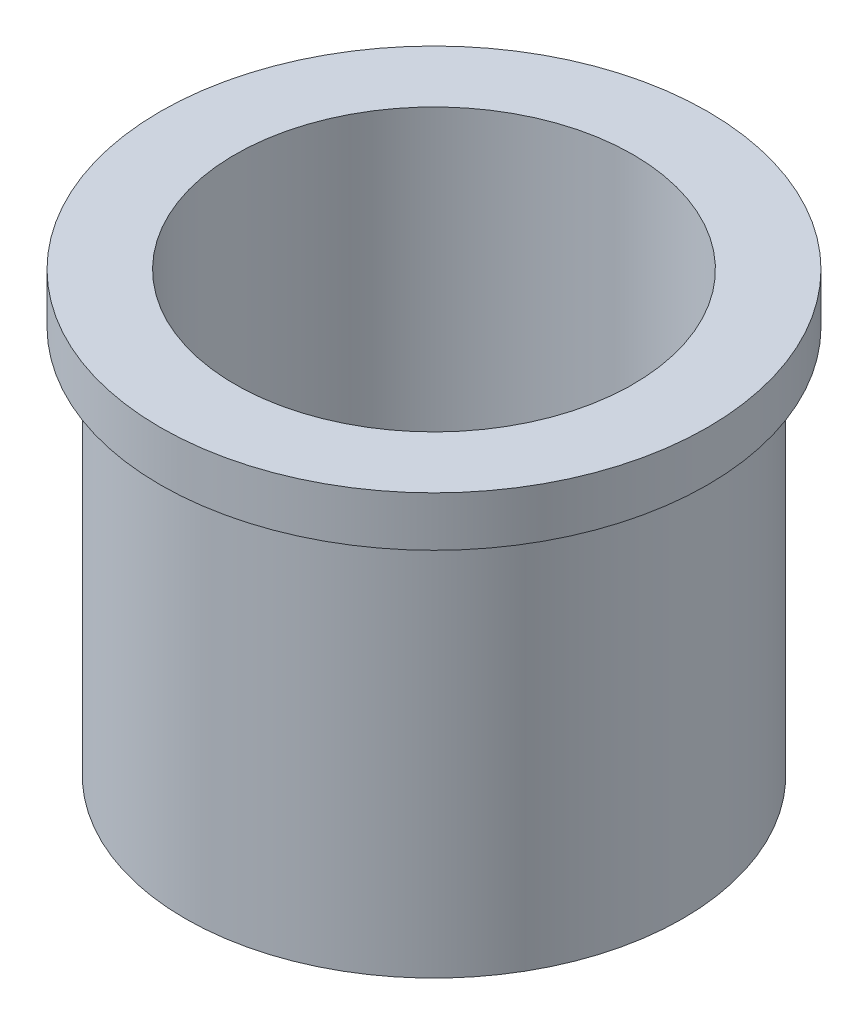
ISO-10303-21;
HEADER;
FILE_DESCRIPTION(('STEP AP214'),'2;1');
FILE_NAME('part.step','',(''),(''),'','','');
FILE_SCHEMA(('AUTOMOTIVE_DESIGN { 1 0 10303 214 1 1 1 1 }'));
ENDSEC;
DATA;
#1=APPLICATION_CONTEXT('core data for automotive mechanical design processes');
#2=APPLICATION_PROTOCOL_DEFINITION('international standard','automotive_design',2000,#1);
#3=PRODUCT_CONTEXT('',#1,'mechanical');
#4=PRODUCT('Part','Part','',(#3));
#5=PRODUCT_RELATED_PRODUCT_CATEGORY('part','',(#4));
#6=PRODUCT_DEFINITION_FORMATION('','',#4);
#7=PRODUCT_DEFINITION_CONTEXT('part definition',#1,'design');
#8=PRODUCT_DEFINITION('design','',#6,#7);
#9=PRODUCT_DEFINITION_SHAPE('','',#8);
#10=(LENGTH_UNIT() NAMED_UNIT(*) SI_UNIT(.MILLI.,.METRE.));
#11=(NAMED_UNIT(*) PLANE_ANGLE_UNIT() SI_UNIT($,.RADIAN.));
#12=(NAMED_UNIT(*) SI_UNIT($,.STERADIAN.) SOLID_ANGLE_UNIT());
#13=UNCERTAINTY_MEASURE_WITH_UNIT(LENGTH_MEASURE(1.E-05),#10,'distance_accuracy_value','');
#14=(GEOMETRIC_REPRESENTATION_CONTEXT(3) GLOBAL_UNCERTAINTY_ASSIGNED_CONTEXT((#13)) GLOBAL_UNIT_ASSIGNED_CONTEXT((#10,
#11,#12)) REPRESENTATION_CONTEXT('',''));
#15=CARTESIAN_POINT('',(0.,0.,0.));
#16=DIRECTION('',(0.,0.,1.));
#17=DIRECTION('',(1.,0.,0.));
#18=AXIS2_PLACEMENT_3D('',#15,#16,#17);
#19=CARTESIAN_POINT('',(0.,19.812,0.));
#20=DIRECTION('',(0.,-1.,0.));
#21=DIRECTION('',(0.,0.,-1.));
#22=AXIS2_PLACEMENT_3D('',#19,#20,#21);
#23=CYLINDRICAL_SURFACE('',#22,12.7);
#24=CARTESIAN_POINT('',(0.,19.812,0.));
#25=DIRECTION('',(0.,1.,0.));
#26=DIRECTION('',(0.,0.,1.));
#27=AXIS2_PLACEMENT_3D('',#24,#25,#26);
#28=CIRCLE('',#27,12.7);
#29=CARTESIAN_POINT('',(0.,19.812,12.7));
#30=VERTEX_POINT('',#29);
#31=EDGE_CURVE('E10',#30,#30,#28,.T.);
#32=ORIENTED_EDGE('',*,*,#31,.F.);
#33=EDGE_LOOP('',(#32));
#34=FACE_BOUND('',#33,.T.);
#35=CARTESIAN_POINT('',(0.,0.,0.));
#36=DIRECTION('',(0.,1.,0.));
#37=DIRECTION('',(0.,0.,1.));
#38=AXIS2_PLACEMENT_3D('',#35,#36,#37);
#39=CIRCLE('',#38,12.7);
#40=CARTESIAN_POINT('',(0.,0.,12.7));
#41=VERTEX_POINT('',#40);
#42=EDGE_CURVE('E35',#41,#41,#39,.T.);
#43=ORIENTED_EDGE('',*,*,#42,.T.);
#44=EDGE_LOOP('',(#43));
#45=FACE_BOUND('',#44,.T.);
#46=ADVANCED_FACE('F32',(#34,#45),#23,.T.);
#47=CARTESIAN_POINT('',(0.,0.,0.));
#48=DIRECTION('',(0.,1.,0.));
#49=DIRECTION('',(0.,0.,1.));
#50=AXIS2_PLACEMENT_3D('',#47,#48,#49);
#51=PLANE('',#50);
#52=CARTESIAN_POINT('',(0.,0.,0.));
#53=DIRECTION('',(0.,-1.,0.));
#54=DIRECTION('',(0.,0.,-1.));
#55=AXIS2_PLACEMENT_3D('',#52,#53,#54);
#56=CIRCLE('',#55,10.16);
#57=CARTESIAN_POINT('',(0.,0.,-10.16));
#58=VERTEX_POINT('',#57);
#59=EDGE_CURVE('E50',#58,#58,#56,.T.);
#60=ORIENTED_EDGE('',*,*,#59,.F.);
#61=EDGE_LOOP('',(#60));
#62=FACE_BOUND('',#61,.T.);
#63=ORIENTED_EDGE('',*,*,#42,.F.);
#64=EDGE_LOOP('',(#63));
#65=FACE_BOUND('',#64,.T.);
#66=ADVANCED_FACE('F66',(#62,#65),#51,.F.);
#67=CARTESIAN_POINT('',(0.,22.352,0.));
#68=DIRECTION('',(0.,-1.,0.));
#69=DIRECTION('',(0.,0.,-1.));
#70=AXIS2_PLACEMENT_3D('',#67,#68,#69);
#71=CYLINDRICAL_SURFACE('',#70,13.97);
#72=CARTESIAN_POINT('',(0.,22.352,0.));
#73=DIRECTION('',(0.,1.,0.));
#74=DIRECTION('',(0.,0.,1.));
#75=AXIS2_PLACEMENT_3D('',#72,#73,#74);
#76=CIRCLE('',#75,13.97);
#77=CARTESIAN_POINT('',(0.,22.352,13.97));
#78=VERTEX_POINT('',#77);
#79=EDGE_CURVE('E42',#78,#78,#76,.T.);
#80=ORIENTED_EDGE('',*,*,#79,.F.);
#81=EDGE_LOOP('',(#80));
#82=FACE_BOUND('',#81,.T.);
#83=CARTESIAN_POINT('',(0.,19.812,0.));
#84=DIRECTION('',(0.,1.,0.));
#85=DIRECTION('',(0.,0.,1.));
#86=AXIS2_PLACEMENT_3D('',#83,#84,#85);
#87=CIRCLE('',#86,13.97);
#88=CARTESIAN_POINT('',(0.,19.812,13.97));
#89=VERTEX_POINT('',#88);
#90=EDGE_CURVE('E44',#89,#89,#87,.T.);
#91=ORIENTED_EDGE('',*,*,#90,.T.);
#92=EDGE_LOOP('',(#91));
#93=FACE_BOUND('',#92,.T.);
#94=ADVANCED_FACE('F69',(#82,#93),#71,.T.);
#95=CARTESIAN_POINT('',(0.,22.352,0.));
#96=DIRECTION('',(0.,1.,0.));
#97=DIRECTION('',(0.,0.,1.));
#98=AXIS2_PLACEMENT_3D('',#95,#96,#97);
#99=PLANE('',#98);
#100=CARTESIAN_POINT('',(0.,22.352,0.));
#101=DIRECTION('',(0.,-1.,0.));
#102=DIRECTION('',(0.,0.,-1.));
#103=AXIS2_PLACEMENT_3D('',#100,#101,#102);
#104=CIRCLE('',#103,10.16);
#105=CARTESIAN_POINT('',(0.,22.352,-10.16));
#106=VERTEX_POINT('',#105);
#107=EDGE_CURVE('E47',#106,#106,#104,.T.);
#108=ORIENTED_EDGE('',*,*,#107,.T.);
#109=EDGE_LOOP('',(#108));
#110=FACE_BOUND('',#109,.T.);
#111=ORIENTED_EDGE('',*,*,#79,.T.);
#112=EDGE_LOOP('',(#111));
#113=FACE_BOUND('',#112,.T.);
#114=ADVANCED_FACE('F56',(#110,#113),#99,.T.);
#115=CARTESIAN_POINT('',(0.,19.812,0.));
#116=DIRECTION('',(0.,1.,0.));
#117=DIRECTION('',(0.,0.,1.));
#118=AXIS2_PLACEMENT_3D('',#115,#116,#117);
#119=PLANE('',#118);
#120=ORIENTED_EDGE('',*,*,#31,.T.);
#121=EDGE_LOOP('',(#120));
#122=FACE_BOUND('',#121,.T.);
#123=ORIENTED_EDGE('',*,*,#90,.F.);
#124=EDGE_LOOP('',(#123));
#125=FACE_BOUND('',#124,.T.);
#126=ADVANCED_FACE('F62',(#122,#125),#119,.F.);
#127=CARTESIAN_POINT('',(0.,22.352,0.));
#128=DIRECTION('',(0.,-1.,0.));
#129=DIRECTION('',(0.,0.,-1.));
#130=AXIS2_PLACEMENT_3D('',#127,#128,#129);
#131=CYLINDRICAL_SURFACE('',#130,10.16);
#132=ORIENTED_EDGE('',*,*,#107,.F.);
#133=EDGE_LOOP('',(#132));
#134=FACE_BOUND('',#133,.T.);
#135=ORIENTED_EDGE('',*,*,#59,.T.);
#136=EDGE_LOOP('',(#135));
#137=FACE_BOUND('',#136,.T.);
#138=ADVANCED_FACE('F59',(#134,#137),#131,.F.);
#139=CLOSED_SHELL('',(#46,#66,#94,#114,#126,#138));
#140=MANIFOLD_SOLID_BREP('B2',#139);
#141=ADVANCED_BREP_SHAPE_REPRESENTATION('',(#18,#140),#14);
#142=SHAPE_DEFINITION_REPRESENTATION(#9,#141);
ENDSEC;
END-ISO-10303-21;
